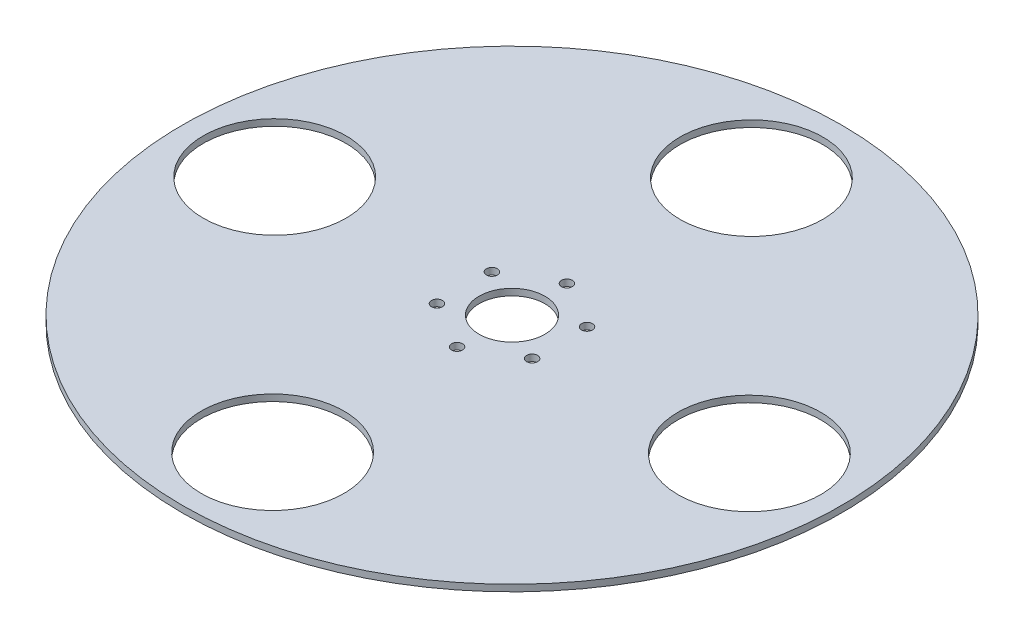
ISO-10303-21;
HEADER;
FILE_DESCRIPTION(('STEP AP214'),'2;1');
FILE_NAME('part.step','',(''),(''),'','','');
FILE_SCHEMA(('AUTOMOTIVE_DESIGN { 1 0 10303 214 1 1 1 1 }'));
ENDSEC;
DATA;
#1=APPLICATION_CONTEXT('core data for automotive mechanical design processes');
#2=APPLICATION_PROTOCOL_DEFINITION('international standard','automotive_design',2000,#1);
#3=PRODUCT_CONTEXT('',#1,'mechanical');
#4=PRODUCT('Part','Part','',(#3));
#5=PRODUCT_RELATED_PRODUCT_CATEGORY('part','',(#4));
#6=PRODUCT_DEFINITION_FORMATION('','',#4);
#7=PRODUCT_DEFINITION_CONTEXT('part definition',#1,'design');
#8=PRODUCT_DEFINITION('design','',#6,#7);
#9=PRODUCT_DEFINITION_SHAPE('','',#8);
#10=(LENGTH_UNIT() NAMED_UNIT(*) SI_UNIT(.MILLI.,.METRE.));
#11=(NAMED_UNIT(*) PLANE_ANGLE_UNIT() SI_UNIT($,.RADIAN.));
#12=(NAMED_UNIT(*) SI_UNIT($,.STERADIAN.) SOLID_ANGLE_UNIT());
#13=UNCERTAINTY_MEASURE_WITH_UNIT(LENGTH_MEASURE(1.E-05),#10,'distance_accuracy_value','');
#14=(GEOMETRIC_REPRESENTATION_CONTEXT(3) GLOBAL_UNCERTAINTY_ASSIGNED_CONTEXT((#13)) GLOBAL_UNIT_ASSIGNED_CONTEXT((#10,
#11,#12)) REPRESENTATION_CONTEXT('',''));
#15=CARTESIAN_POINT('',(0.,0.,0.));
#16=DIRECTION('',(0.,0.,1.));
#17=DIRECTION('',(1.,0.,0.));
#18=AXIS2_PLACEMENT_3D('',#15,#16,#17);
#19=CARTESIAN_POINT('',(0.,3.,0.));
#20=DIRECTION('',(0.,1.,0.));
#21=DIRECTION('',(0.,0.,1.));
#22=AXIS2_PLACEMENT_3D('',#19,#20,#21);
#23=PLANE('',#22);
#24=CARTESIAN_POINT('',(-0.46870693924015,3.,108.498987616499));
#25=DIRECTION('',(0.,1.,0.));
#26=DIRECTION('',(0.,0.,1.));
#27=AXIS2_PLACEMENT_3D('',#24,#25,#26);
#28=CIRCLE('',#27,32.5);
#29=CARTESIAN_POINT('',(-0.46870693924015,3.,140.998987616499));
#30=VERTEX_POINT('',#29);
#31=EDGE_CURVE('E127',#30,#30,#28,.T.);
#32=ORIENTED_EDGE('',*,*,#31,.F.);
#33=EDGE_LOOP('',(#32));
#34=FACE_BOUND('',#33,.T.);
#35=CARTESIAN_POINT('',(-21.6506350946108,3.,-12.5000000000003));
#36=DIRECTION('',(0.,1.,0.));
#37=DIRECTION('',(0.,0.,1.));
#38=AXIS2_PLACEMENT_3D('',#35,#36,#37);
#39=CIRCLE('',#38,2.5);
#40=CARTESIAN_POINT('',(-21.6506350946108,3.,-10.0000000000003));
#41=VERTEX_POINT('',#40);
#42=EDGE_CURVE('E109',#41,#41,#39,.T.);
#43=ORIENTED_EDGE('',*,*,#42,.F.);
#44=EDGE_LOOP('',(#43));
#45=FACE_BOUND('',#44,.T.);
#46=CARTESIAN_POINT('',(-1.74574066942157E-13,3.,25.));
#47=DIRECTION('',(0.,1.,0.));
#48=DIRECTION('',(0.,0.,1.));
#49=AXIS2_PLACEMENT_3D('',#46,#47,#48);
#50=CIRCLE('',#49,2.5);
#51=CARTESIAN_POINT('',(-1.74574066942157E-13,3.,27.5));
#52=VERTEX_POINT('',#51);
#53=EDGE_CURVE('E94',#52,#52,#50,.T.);
#54=ORIENTED_EDGE('',*,*,#53,.F.);
#55=EDGE_LOOP('',(#54));
#56=FACE_BOUND('',#55,.T.);
#57=CARTESIAN_POINT('',(21.650635094611,3.,-12.5));
#58=DIRECTION('',(0.,1.,0.));
#59=DIRECTION('',(0.,0.,1.));
#60=AXIS2_PLACEMENT_3D('',#57,#58,#59);
#61=CIRCLE('',#60,2.5);
#62=CARTESIAN_POINT('',(21.650635094611,3.,-9.99999999999995));
#63=VERTEX_POINT('',#62);
#64=EDGE_CURVE('E79',#63,#63,#61,.T.);
#65=ORIENTED_EDGE('',*,*,#64,.F.);
#66=EDGE_LOOP('',(#65));
#67=FACE_BOUND('',#66,.T.);
#68=CARTESIAN_POINT('',(0.,3.,-25.));
#69=DIRECTION('',(0.,1.,0.));
#70=DIRECTION('',(0.,0.,1.));
#71=AXIS2_PLACEMENT_3D('',#68,#69,#70);
#72=CIRCLE('',#71,2.5);
#73=CARTESIAN_POINT('',(0.,3.,-22.5));
#74=VERTEX_POINT('',#73);
#75=EDGE_CURVE('E65',#74,#74,#72,.T.);
#76=ORIENTED_EDGE('',*,*,#75,.F.);
#77=EDGE_LOOP('',(#76));
#78=FACE_BOUND('',#77,.T.);
#79=CARTESIAN_POINT('',(0.,3.,0.));
#80=DIRECTION('',(0.,1.,0.));
#81=DIRECTION('',(0.,0.,1.));
#82=AXIS2_PLACEMENT_3D('',#79,#80,#81);
#83=CIRCLE('',#82,150.);
#84=CARTESIAN_POINT('',(0.,3.,150.));
#85=VERTEX_POINT('',#84);
#86=EDGE_CURVE('E10',#85,#85,#83,.T.);
#87=ORIENTED_EDGE('',*,*,#86,.T.);
#88=EDGE_LOOP('',(#87));
#89=FACE_BOUND('',#88,.T.);
#90=CARTESIAN_POINT('',(0.,3.,0.));
#91=DIRECTION('',(0.,1.,0.));
#92=DIRECTION('',(0.,0.,1.));
#93=AXIS2_PLACEMENT_3D('',#90,#91,#92);
#94=CIRCLE('',#93,15.);
#95=CARTESIAN_POINT('',(0.,3.,15.));
#96=VERTEX_POINT('',#95);
#97=EDGE_CURVE('E57',#96,#96,#94,.T.);
#98=ORIENTED_EDGE('',*,*,#97,.F.);
#99=EDGE_LOOP('',(#98));
#100=FACE_BOUND('',#99,.T.);
#101=CARTESIAN_POINT('',(0.468706939240164,3.,-108.498987616499));
#102=DIRECTION('',(0.,1.,0.));
#103=DIRECTION('',(0.,0.,1.));
#104=AXIS2_PLACEMENT_3D('',#101,#102,#103);
#105=CIRCLE('',#104,32.5);
#106=CARTESIAN_POINT('',(0.468706939240164,3.,-75.9989876164985));
#107=VERTEX_POINT('',#106);
#108=EDGE_CURVE('E68',#107,#107,#105,.T.);
#109=ORIENTED_EDGE('',*,*,#108,.F.);
#110=EDGE_LOOP('',(#109));
#111=FACE_BOUND('',#110,.T.);
#112=CARTESIAN_POINT('',(21.6506350946109,3.,12.5000000000001));
#113=DIRECTION('',(0.,1.,0.));
#114=DIRECTION('',(0.,0.,1.));
#115=AXIS2_PLACEMENT_3D('',#112,#113,#114);
#116=CIRCLE('',#115,2.5);
#117=CARTESIAN_POINT('',(21.6506350946109,3.,15.0000000000001));
#118=VERTEX_POINT('',#117);
#119=EDGE_CURVE('E88',#118,#118,#116,.T.);
#120=ORIENTED_EDGE('',*,*,#119,.F.);
#121=EDGE_LOOP('',(#120));
#122=FACE_BOUND('',#121,.T.);
#123=CARTESIAN_POINT('',(-21.6506350946111,3.,12.4999999999998));
#124=DIRECTION('',(0.,1.,0.));
#125=DIRECTION('',(0.,0.,1.));
#126=AXIS2_PLACEMENT_3D('',#123,#124,#125);
#127=CIRCLE('',#126,2.5);
#128=CARTESIAN_POINT('',(-21.6506350946111,3.,14.9999999999998));
#129=VERTEX_POINT('',#128);
#130=EDGE_CURVE('E105',#129,#129,#127,.T.);
#131=ORIENTED_EDGE('',*,*,#130,.F.);
#132=EDGE_LOOP('',(#131));
#133=FACE_BOUND('',#132,.T.);
#134=CARTESIAN_POINT('',(108.498987616499,3.,0.468706939240157));
#135=DIRECTION('',(0.,1.,0.));
#136=DIRECTION('',(0.,0.,1.));
#137=AXIS2_PLACEMENT_3D('',#134,#135,#136);
#138=CIRCLE('',#137,32.5);
#139=CARTESIAN_POINT('',(108.498987616499,3.,32.9687069392401));
#140=VERTEX_POINT('',#139);
#141=EDGE_CURVE('E119',#140,#140,#138,.T.);
#142=ORIENTED_EDGE('',*,*,#141,.F.);
#143=EDGE_LOOP('',(#142));
#144=FACE_BOUND('',#143,.T.);
#145=CARTESIAN_POINT('',(-108.498987616499,3.,-0.46870693924017));
#146=DIRECTION('',(0.,1.,0.));
#147=DIRECTION('',(0.,0.,1.));
#148=AXIS2_PLACEMENT_3D('',#145,#146,#147);
#149=CIRCLE('',#148,32.5);
#150=CARTESIAN_POINT('',(-108.498987616499,3.,32.0312930607599));
#151=VERTEX_POINT('',#150);
#152=EDGE_CURVE('E131',#151,#151,#149,.T.);
#153=ORIENTED_EDGE('',*,*,#152,.F.);
#154=EDGE_LOOP('',(#153));
#155=FACE_BOUND('',#154,.T.);
#156=ADVANCED_FACE('F43',(#34,#45,#56,#67,#78,#89,#100,#111,#122,#133,#144,#155),#23,.T.);
#157=CARTESIAN_POINT('',(0.,0.,0.));
#158=DIRECTION('',(0.,1.,0.));
#159=DIRECTION('',(0.,0.,1.));
#160=AXIS2_PLACEMENT_3D('',#157,#158,#159);
#161=PLANE('',#160);
#162=CARTESIAN_POINT('',(0.,0.,0.));
#163=DIRECTION('',(0.,1.,0.));
#164=DIRECTION('',(0.,0.,1.));
#165=AXIS2_PLACEMENT_3D('',#162,#163,#164);
#166=CIRCLE('',#165,150.);
#167=CARTESIAN_POINT('',(0.,0.,150.));
#168=VERTEX_POINT('',#167);
#169=EDGE_CURVE('E50',#168,#168,#166,.T.);
#170=ORIENTED_EDGE('',*,*,#169,.F.);
#171=EDGE_LOOP('',(#170));
#172=FACE_BOUND('',#171,.T.);
#173=CARTESIAN_POINT('',(0.,0.,0.));
#174=DIRECTION('',(0.,1.,0.));
#175=DIRECTION('',(0.,0.,1.));
#176=AXIS2_PLACEMENT_3D('',#173,#174,#175);
#177=CIRCLE('',#176,15.);
#178=CARTESIAN_POINT('',(0.,0.,15.));
#179=VERTEX_POINT('',#178);
#180=EDGE_CURVE('E59',#179,#179,#177,.T.);
#181=ORIENTED_EDGE('',*,*,#180,.T.);
#182=EDGE_LOOP('',(#181));
#183=FACE_BOUND('',#182,.T.);
#184=CARTESIAN_POINT('',(0.,0.,-25.));
#185=DIRECTION('',(0.,1.,0.));
#186=DIRECTION('',(0.,0.,1.));
#187=AXIS2_PLACEMENT_3D('',#184,#185,#186);
#188=CIRCLE('',#187,2.5);
#189=CARTESIAN_POINT('',(0.,0.,-22.5));
#190=VERTEX_POINT('',#189);
#191=EDGE_CURVE('E67',#190,#190,#188,.T.);
#192=ORIENTED_EDGE('',*,*,#191,.T.);
#193=EDGE_LOOP('',(#192));
#194=FACE_BOUND('',#193,.T.);
#195=CARTESIAN_POINT('',(0.468706939240164,0.,-108.498987616499));
#196=DIRECTION('',(0.,1.,0.));
#197=DIRECTION('',(0.,0.,1.));
#198=AXIS2_PLACEMENT_3D('',#195,#196,#197);
#199=CIRCLE('',#198,32.5);
#200=CARTESIAN_POINT('',(0.468706939240164,0.,-75.9989876164985));
#201=VERTEX_POINT('',#200);
#202=EDGE_CURVE('E74',#201,#201,#199,.T.);
#203=ORIENTED_EDGE('',*,*,#202,.T.);
#204=EDGE_LOOP('',(#203));
#205=FACE_BOUND('',#204,.T.);
#206=CARTESIAN_POINT('',(21.650635094611,0.,-12.5));
#207=DIRECTION('',(0.,1.,0.));
#208=DIRECTION('',(0.,0.,1.));
#209=AXIS2_PLACEMENT_3D('',#206,#207,#208);
#210=CIRCLE('',#209,2.5);
#211=CARTESIAN_POINT('',(21.650635094611,0.,-9.99999999999995));
#212=VERTEX_POINT('',#211);
#213=EDGE_CURVE('E84',#212,#212,#210,.T.);
#214=ORIENTED_EDGE('',*,*,#213,.T.);
#215=EDGE_LOOP('',(#214));
#216=FACE_BOUND('',#215,.T.);
#217=CARTESIAN_POINT('',(21.6506350946109,0.,12.5000000000001));
#218=DIRECTION('',(0.,1.,0.));
#219=DIRECTION('',(0.,0.,1.));
#220=AXIS2_PLACEMENT_3D('',#217,#218,#219);
#221=CIRCLE('',#220,2.5);
#222=CARTESIAN_POINT('',(21.6506350946109,0.,15.0000000000001));
#223=VERTEX_POINT('',#222);
#224=EDGE_CURVE('E89',#223,#223,#221,.T.);
#225=ORIENTED_EDGE('',*,*,#224,.T.);
#226=EDGE_LOOP('',(#225));
#227=FACE_BOUND('',#226,.T.);
#228=CARTESIAN_POINT('',(-1.74574066942157E-13,0.,25.));
#229=DIRECTION('',(0.,1.,0.));
#230=DIRECTION('',(0.,0.,1.));
#231=AXIS2_PLACEMENT_3D('',#228,#229,#230);
#232=CIRCLE('',#231,2.5);
#233=CARTESIAN_POINT('',(-1.74574066942157E-13,0.,27.5));
#234=VERTEX_POINT('',#233);
#235=EDGE_CURVE('E98',#234,#234,#232,.T.);
#236=ORIENTED_EDGE('',*,*,#235,.T.);
#237=EDGE_LOOP('',(#236));
#238=FACE_BOUND('',#237,.T.);
#239=CARTESIAN_POINT('',(-21.6506350946111,0.,12.4999999999998));
#240=DIRECTION('',(0.,1.,0.));
#241=DIRECTION('',(0.,0.,1.));
#242=AXIS2_PLACEMENT_3D('',#239,#240,#241);
#243=CIRCLE('',#242,2.5);
#244=CARTESIAN_POINT('',(-21.6506350946111,0.,14.9999999999998));
#245=VERTEX_POINT('',#244);
#246=EDGE_CURVE('E106',#245,#245,#243,.T.);
#247=ORIENTED_EDGE('',*,*,#246,.T.);
#248=EDGE_LOOP('',(#247));
#249=FACE_BOUND('',#248,.T.);
#250=CARTESIAN_POINT('',(-21.6506350946108,0.,-12.5000000000003));
#251=DIRECTION('',(0.,1.,0.));
#252=DIRECTION('',(0.,0.,1.));
#253=AXIS2_PLACEMENT_3D('',#250,#251,#252);
#254=CIRCLE('',#253,2.5);
#255=CARTESIAN_POINT('',(-21.6506350946108,0.,-10.0000000000003));
#256=VERTEX_POINT('',#255);
#257=EDGE_CURVE('E111',#256,#256,#254,.T.);
#258=ORIENTED_EDGE('',*,*,#257,.T.);
#259=EDGE_LOOP('',(#258));
#260=FACE_BOUND('',#259,.T.);
#261=CARTESIAN_POINT('',(108.498987616499,0.,0.468706939240157));
#262=DIRECTION('',(0.,1.,0.));
#263=DIRECTION('',(0.,0.,1.));
#264=AXIS2_PLACEMENT_3D('',#261,#262,#263);
#265=CIRCLE('',#264,32.5);
#266=CARTESIAN_POINT('',(108.498987616499,0.,32.9687069392401));
#267=VERTEX_POINT('',#266);
#268=EDGE_CURVE('E124',#267,#267,#265,.T.);
#269=ORIENTED_EDGE('',*,*,#268,.T.);
#270=EDGE_LOOP('',(#269));
#271=FACE_BOUND('',#270,.T.);
#272=CARTESIAN_POINT('',(-0.46870693924015,0.,108.498987616499));
#273=DIRECTION('',(0.,1.,0.));
#274=DIRECTION('',(0.,0.,1.));
#275=AXIS2_PLACEMENT_3D('',#272,#273,#274);
#276=CIRCLE('',#275,32.5);
#277=CARTESIAN_POINT('',(-0.46870693924015,0.,140.998987616499));
#278=VERTEX_POINT('',#277);
#279=EDGE_CURVE('E128',#278,#278,#276,.T.);
#280=ORIENTED_EDGE('',*,*,#279,.T.);
#281=EDGE_LOOP('',(#280));
#282=FACE_BOUND('',#281,.T.);
#283=CARTESIAN_POINT('',(-108.498987616499,0.,-0.46870693924017));
#284=DIRECTION('',(0.,1.,0.));
#285=DIRECTION('',(0.,0.,1.));
#286=AXIS2_PLACEMENT_3D('',#283,#284,#285);
#287=CIRCLE('',#286,32.5);
#288=CARTESIAN_POINT('',(-108.498987616499,0.,32.0312930607599));
#289=VERTEX_POINT('',#288);
#290=EDGE_CURVE('E140',#289,#289,#287,.T.);
#291=ORIENTED_EDGE('',*,*,#290,.T.);
#292=EDGE_LOOP('',(#291));
#293=FACE_BOUND('',#292,.T.);
#294=ADVANCED_FACE('F147',(#172,#183,#194,#205,#216,#227,#238,#249,#260,#271,#282,#293),#161,.F.);
#295=CARTESIAN_POINT('',(0.,3.,0.));
#296=DIRECTION('',(0.,-1.,0.));
#297=DIRECTION('',(0.,0.,-1.));
#298=AXIS2_PLACEMENT_3D('',#295,#296,#297);
#299=CYLINDRICAL_SURFACE('',#298,150.);
#300=ORIENTED_EDGE('',*,*,#86,.F.);
#301=EDGE_LOOP('',(#300));
#302=FACE_BOUND('',#301,.T.);
#303=ORIENTED_EDGE('',*,*,#169,.T.);
#304=EDGE_LOOP('',(#303));
#305=FACE_BOUND('',#304,.T.);
#306=ADVANCED_FACE('F44',(#302,#305),#299,.T.);
#307=CARTESIAN_POINT('',(0.,3.,0.));
#308=DIRECTION('',(0.,-1.,0.));
#309=DIRECTION('',(0.,0.,-1.));
#310=AXIS2_PLACEMENT_3D('',#307,#308,#309);
#311=CYLINDRICAL_SURFACE('',#310,15.);
#312=ORIENTED_EDGE('',*,*,#97,.T.);
#313=EDGE_LOOP('',(#312));
#314=FACE_BOUND('',#313,.T.);
#315=ORIENTED_EDGE('',*,*,#180,.F.);
#316=EDGE_LOOP('',(#315));
#317=FACE_BOUND('',#316,.T.);
#318=ADVANCED_FACE('F159',(#314,#317),#311,.F.);
#319=CARTESIAN_POINT('',(0.,3.,-25.));
#320=DIRECTION('',(0.,-1.,0.));
#321=DIRECTION('',(0.,0.,-1.));
#322=AXIS2_PLACEMENT_3D('',#319,#320,#321);
#323=CYLINDRICAL_SURFACE('',#322,2.5);
#324=ORIENTED_EDGE('',*,*,#75,.T.);
#325=EDGE_LOOP('',(#324));
#326=FACE_BOUND('',#325,.T.);
#327=ORIENTED_EDGE('',*,*,#191,.F.);
#328=EDGE_LOOP('',(#327));
#329=FACE_BOUND('',#328,.T.);
#330=ADVANCED_FACE('F162',(#326,#329),#323,.F.);
#331=CARTESIAN_POINT('',(0.468706939240164,3.,-108.498987616499));
#332=DIRECTION('',(0.,-1.,0.));
#333=DIRECTION('',(0.,0.,-1.));
#334=AXIS2_PLACEMENT_3D('',#331,#332,#333);
#335=CYLINDRICAL_SURFACE('',#334,32.5);
#336=ORIENTED_EDGE('',*,*,#108,.T.);
#337=EDGE_LOOP('',(#336));
#338=FACE_BOUND('',#337,.T.);
#339=ORIENTED_EDGE('',*,*,#202,.F.);
#340=EDGE_LOOP('',(#339));
#341=FACE_BOUND('',#340,.T.);
#342=ADVANCED_FACE('F170',(#338,#341),#335,.F.);
#343=CARTESIAN_POINT('',(21.650635094611,3.,-12.5));
#344=DIRECTION('',(0.,-1.,0.));
#345=DIRECTION('',(0.,0.,-1.));
#346=AXIS2_PLACEMENT_3D('',#343,#344,#345);
#347=CYLINDRICAL_SURFACE('',#346,2.5);
#348=ORIENTED_EDGE('',*,*,#64,.T.);
#349=EDGE_LOOP('',(#348));
#350=FACE_BOUND('',#349,.T.);
#351=ORIENTED_EDGE('',*,*,#213,.F.);
#352=EDGE_LOOP('',(#351));
#353=FACE_BOUND('',#352,.T.);
#354=ADVANCED_FACE('F172',(#350,#353),#347,.F.);
#355=CARTESIAN_POINT('',(21.6506350946109,3.,12.5000000000001));
#356=DIRECTION('',(0.,-1.,0.));
#357=DIRECTION('',(0.,0.,-1.));
#358=AXIS2_PLACEMENT_3D('',#355,#356,#357);
#359=CYLINDRICAL_SURFACE('',#358,2.5);
#360=ORIENTED_EDGE('',*,*,#119,.T.);
#361=EDGE_LOOP('',(#360));
#362=FACE_BOUND('',#361,.T.);
#363=ORIENTED_EDGE('',*,*,#224,.F.);
#364=EDGE_LOOP('',(#363));
#365=FACE_BOUND('',#364,.T.);
#366=ADVANCED_FACE('F173',(#362,#365),#359,.F.);
#367=CARTESIAN_POINT('',(-1.74574066942157E-13,3.,25.));
#368=DIRECTION('',(0.,-1.,0.));
#369=DIRECTION('',(0.,0.,-1.));
#370=AXIS2_PLACEMENT_3D('',#367,#368,#369);
#371=CYLINDRICAL_SURFACE('',#370,2.5);
#372=ORIENTED_EDGE('',*,*,#53,.T.);
#373=EDGE_LOOP('',(#372));
#374=FACE_BOUND('',#373,.T.);
#375=ORIENTED_EDGE('',*,*,#235,.F.);
#376=EDGE_LOOP('',(#375));
#377=FACE_BOUND('',#376,.T.);
#378=ADVANCED_FACE('F176',(#374,#377),#371,.F.);
#379=CARTESIAN_POINT('',(-21.6506350946111,3.,12.4999999999998));
#380=DIRECTION('',(0.,-1.,0.));
#381=DIRECTION('',(0.,0.,-1.));
#382=AXIS2_PLACEMENT_3D('',#379,#380,#381);
#383=CYLINDRICAL_SURFACE('',#382,2.5);
#384=ORIENTED_EDGE('',*,*,#130,.T.);
#385=EDGE_LOOP('',(#384));
#386=FACE_BOUND('',#385,.T.);
#387=ORIENTED_EDGE('',*,*,#246,.F.);
#388=EDGE_LOOP('',(#387));
#389=FACE_BOUND('',#388,.T.);
#390=ADVANCED_FACE('F181',(#386,#389),#383,.F.);
#391=CARTESIAN_POINT('',(-21.6506350946108,3.,-12.5000000000003));
#392=DIRECTION('',(0.,-1.,0.));
#393=DIRECTION('',(0.,0.,-1.));
#394=AXIS2_PLACEMENT_3D('',#391,#392,#393);
#395=CYLINDRICAL_SURFACE('',#394,2.5);
#396=ORIENTED_EDGE('',*,*,#42,.T.);
#397=EDGE_LOOP('',(#396));
#398=FACE_BOUND('',#397,.T.);
#399=ORIENTED_EDGE('',*,*,#257,.F.);
#400=EDGE_LOOP('',(#399));
#401=FACE_BOUND('',#400,.T.);
#402=ADVANCED_FACE('F190',(#398,#401),#395,.F.);
#403=CARTESIAN_POINT('',(108.498987616499,3.,0.468706939240157));
#404=DIRECTION('',(0.,-1.,0.));
#405=DIRECTION('',(0.,0.,-1.));
#406=AXIS2_PLACEMENT_3D('',#403,#404,#405);
#407=CYLINDRICAL_SURFACE('',#406,32.5);
#408=ORIENTED_EDGE('',*,*,#141,.T.);
#409=EDGE_LOOP('',(#408));
#410=FACE_BOUND('',#409,.T.);
#411=ORIENTED_EDGE('',*,*,#268,.F.);
#412=EDGE_LOOP('',(#411));
#413=FACE_BOUND('',#412,.T.);
#414=ADVANCED_FACE('F192',(#410,#413),#407,.F.);
#415=CARTESIAN_POINT('',(-0.46870693924015,3.,108.498987616499));
#416=DIRECTION('',(0.,-1.,0.));
#417=DIRECTION('',(0.,0.,-1.));
#418=AXIS2_PLACEMENT_3D('',#415,#416,#417);
#419=CYLINDRICAL_SURFACE('',#418,32.5);
#420=ORIENTED_EDGE('',*,*,#31,.T.);
#421=EDGE_LOOP('',(#420));
#422=FACE_BOUND('',#421,.T.);
#423=ORIENTED_EDGE('',*,*,#279,.F.);
#424=EDGE_LOOP('',(#423));
#425=FACE_BOUND('',#424,.T.);
#426=ADVANCED_FACE('F193',(#422,#425),#419,.F.);
#427=CARTESIAN_POINT('',(-108.498987616499,3.,-0.46870693924017));
#428=DIRECTION('',(0.,-1.,0.));
#429=DIRECTION('',(0.,0.,-1.));
#430=AXIS2_PLACEMENT_3D('',#427,#428,#429);
#431=CYLINDRICAL_SURFACE('',#430,32.5);
#432=ORIENTED_EDGE('',*,*,#152,.T.);
#433=EDGE_LOOP('',(#432));
#434=FACE_BOUND('',#433,.T.);
#435=ORIENTED_EDGE('',*,*,#290,.F.);
#436=EDGE_LOOP('',(#435));
#437=FACE_BOUND('',#436,.T.);
#438=ADVANCED_FACE('F148',(#434,#437),#431,.F.);
#439=CLOSED_SHELL('',(#156,#294,#306,#318,#330,#342,#354,#366,#378,#390,#402,#414,#426,#438));
#440=MANIFOLD_SOLID_BREP('B2',#439);
#441=ADVANCED_BREP_SHAPE_REPRESENTATION('',(#18,#440),#14);
#442=SHAPE_DEFINITION_REPRESENTATION(#9,#441);
ENDSEC;
END-ISO-10303-21;
